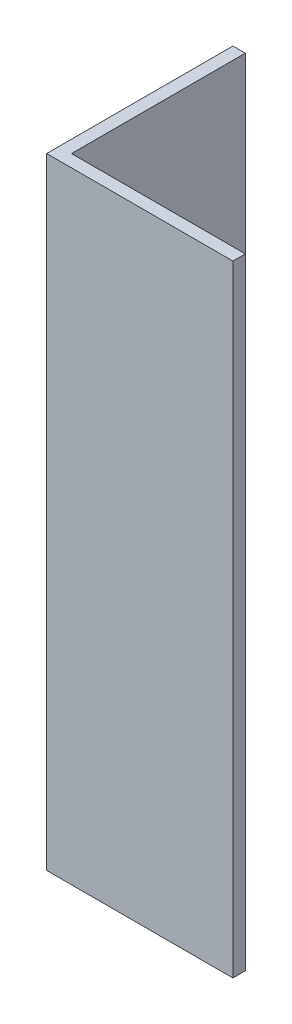
ISO-10303-21;
HEADER;
FILE_DESCRIPTION(('STEP AP214'),'2;1');
FILE_NAME('part.step','',(''),(''),'','','');
FILE_SCHEMA(('AUTOMOTIVE_DESIGN { 1 0 10303 214 1 1 1 1 }'));
ENDSEC;
DATA;
#1=APPLICATION_CONTEXT('core data for automotive mechanical design processes');
#2=APPLICATION_PROTOCOL_DEFINITION('international standard','automotive_design',2000,#1);
#3=PRODUCT_CONTEXT('',#1,'mechanical');
#4=PRODUCT('Part','Part','',(#3));
#5=PRODUCT_RELATED_PRODUCT_CATEGORY('part','',(#4));
#6=PRODUCT_DEFINITION_FORMATION('','',#4);
#7=PRODUCT_DEFINITION_CONTEXT('part definition',#1,'design');
#8=PRODUCT_DEFINITION('design','',#6,#7);
#9=PRODUCT_DEFINITION_SHAPE('','',#8);
#10=(LENGTH_UNIT() NAMED_UNIT(*) SI_UNIT(.MILLI.,.METRE.));
#11=(NAMED_UNIT(*) PLANE_ANGLE_UNIT() SI_UNIT($,.RADIAN.));
#12=(NAMED_UNIT(*) SI_UNIT($,.STERADIAN.) SOLID_ANGLE_UNIT());
#13=UNCERTAINTY_MEASURE_WITH_UNIT(LENGTH_MEASURE(1.E-05),#10,'distance_accuracy_value','');
#14=(GEOMETRIC_REPRESENTATION_CONTEXT(3) GLOBAL_UNCERTAINTY_ASSIGNED_CONTEXT((#13)) GLOBAL_UNIT_ASSIGNED_CONTEXT((#10,
#11,#12)) REPRESENTATION_CONTEXT('',''));
#15=CARTESIAN_POINT('',(0.,0.,0.));
#16=DIRECTION('',(0.,0.,1.));
#17=DIRECTION('',(1.,0.,0.));
#18=AXIS2_PLACEMENT_3D('',#15,#16,#17);
#19=CARTESIAN_POINT('',(15.,50.,0.));
#20=DIRECTION('',(0.,0.,-1.));
#21=DIRECTION('',(-1.,0.,0.));
#22=AXIS2_PLACEMENT_3D('',#19,#20,#21);
#23=PLANE('',#22);
#24=DIRECTION('',(1.,0.,0.));
#25=VECTOR('',#24,1.);
#26=CARTESIAN_POINT('',(15.,0.,0.));
#27=LINE('',#26,#25);
#28=CARTESIAN_POINT('',(0.,0.,0.));
#29=VERTEX_POINT('',#28);
#30=CARTESIAN_POINT('',(15.,0.,0.));
#31=VERTEX_POINT('',#30);
#32=EDGE_CURVE('E121',#29,#31,#27,.T.);
#33=ORIENTED_EDGE('',*,*,#32,.T.);
#34=DIRECTION('',(0.,-1.,0.));
#35=VECTOR('',#34,1.);
#36=CARTESIAN_POINT('',(15.,50.,0.));
#37=LINE('',#36,#35);
#38=CARTESIAN_POINT('',(15.,50.,0.));
#39=VERTEX_POINT('',#38);
#40=EDGE_CURVE('E11',#39,#31,#37,.T.);
#41=ORIENTED_EDGE('',*,*,#40,.F.);
#42=DIRECTION('',(1.,0.,0.));
#43=VECTOR('',#42,1.);
#44=CARTESIAN_POINT('',(15.,50.,0.));
#45=LINE('',#44,#43);
#46=CARTESIAN_POINT('',(0.,50.,0.));
#47=VERTEX_POINT('',#46);
#48=EDGE_CURVE('E131',#47,#39,#45,.T.);
#49=ORIENTED_EDGE('',*,*,#48,.F.);
#50=DIRECTION('',(0.,-1.,0.));
#51=VECTOR('',#50,1.);
#52=CARTESIAN_POINT('',(0.,50.,0.));
#53=LINE('',#52,#51);
#54=EDGE_CURVE('E117',#47,#29,#53,.T.);
#55=ORIENTED_EDGE('',*,*,#54,.T.);
#56=EDGE_LOOP('',(#33,#41,#49,#55));
#57=FACE_BOUND('',#56,.T.);
#58=ADVANCED_FACE('F37',(#57),#23,.F.);
#59=CARTESIAN_POINT('',(15.,50.,-0.999999999999998));
#60=DIRECTION('',(-1.,0.,0.));
#61=DIRECTION('',(0.,0.,1.));
#62=AXIS2_PLACEMENT_3D('',#59,#60,#61);
#63=PLANE('',#62);
#64=DIRECTION('',(0.,0.,-1.));
#65=VECTOR('',#64,1.);
#66=CARTESIAN_POINT('',(15.,0.,-0.999999999999998));
#67=LINE('',#66,#65);
#68=CARTESIAN_POINT('',(15.,0.,-0.999999999999998));
#69=VERTEX_POINT('',#68);
#70=EDGE_CURVE('E124',#31,#69,#67,.T.);
#71=ORIENTED_EDGE('',*,*,#70,.T.);
#72=DIRECTION('',(0.,-1.,0.));
#73=VECTOR('',#72,1.);
#74=CARTESIAN_POINT('',(15.,50.,-0.999999999999998));
#75=LINE('',#74,#73);
#76=CARTESIAN_POINT('',(15.,50.,-0.999999999999998));
#77=VERTEX_POINT('',#76);
#78=EDGE_CURVE('E45',#77,#69,#75,.T.);
#79=ORIENTED_EDGE('',*,*,#78,.F.);
#80=DIRECTION('',(0.,0.,-1.));
#81=VECTOR('',#80,1.);
#82=CARTESIAN_POINT('',(15.,50.,-0.999999999999998));
#83=LINE('',#82,#81);
#84=EDGE_CURVE('E90',#39,#77,#83,.T.);
#85=ORIENTED_EDGE('',*,*,#84,.F.);
#86=ORIENTED_EDGE('',*,*,#40,.T.);
#87=EDGE_LOOP('',(#71,#79,#85,#86));
#88=FACE_BOUND('',#87,.T.);
#89=ADVANCED_FACE('F155',(#88),#63,.F.);
#90=CARTESIAN_POINT('',(1.,50.,-0.999999999999997));
#91=DIRECTION('',(0.,0.,1.));
#92=DIRECTION('',(1.,0.,0.));
#93=AXIS2_PLACEMENT_3D('',#90,#91,#92);
#94=PLANE('',#93);
#95=DIRECTION('',(-1.,0.,0.));
#96=VECTOR('',#95,1.);
#97=CARTESIAN_POINT('',(1.,0.,-0.999999999999997));
#98=LINE('',#97,#96);
#99=CARTESIAN_POINT('',(1.,0.,-0.999999999999997));
#100=VERTEX_POINT('',#99);
#101=EDGE_CURVE('E126',#69,#100,#98,.T.);
#102=ORIENTED_EDGE('',*,*,#101,.T.);
#103=DIRECTION('',(0.,-1.,0.));
#104=VECTOR('',#103,1.);
#105=CARTESIAN_POINT('',(1.,50.,-0.999999999999997));
#106=LINE('',#105,#104);
#107=CARTESIAN_POINT('',(1.,50.,-0.999999999999997));
#108=VERTEX_POINT('',#107);
#109=EDGE_CURVE('E112',#108,#100,#106,.T.);
#110=ORIENTED_EDGE('',*,*,#109,.F.);
#111=DIRECTION('',(-1.,0.,0.));
#112=VECTOR('',#111,1.);
#113=CARTESIAN_POINT('',(1.,50.,-0.999999999999997));
#114=LINE('',#113,#112);
#115=EDGE_CURVE('E103',#77,#108,#114,.T.);
#116=ORIENTED_EDGE('',*,*,#115,.F.);
#117=ORIENTED_EDGE('',*,*,#78,.T.);
#118=EDGE_LOOP('',(#102,#110,#116,#117));
#119=FACE_BOUND('',#118,.T.);
#120=ADVANCED_FACE('F137',(#119),#94,.F.);
#121=CARTESIAN_POINT('',(0.999999999999998,50.,-15.));
#122=DIRECTION('',(-1.,0.,0.));
#123=DIRECTION('',(0.,0.,1.));
#124=AXIS2_PLACEMENT_3D('',#121,#122,#123);
#125=PLANE('',#124);
#126=DIRECTION('',(0.,0.,-1.));
#127=VECTOR('',#126,1.);
#128=CARTESIAN_POINT('',(0.999999999999998,0.,-15.));
#129=LINE('',#128,#127);
#130=CARTESIAN_POINT('',(0.999999999999998,0.,-15.));
#131=VERTEX_POINT('',#130);
#132=EDGE_CURVE('E111',#100,#131,#129,.T.);
#133=ORIENTED_EDGE('',*,*,#132,.T.);
#134=DIRECTION('',(0.,-1.,0.));
#135=VECTOR('',#134,1.);
#136=CARTESIAN_POINT('',(0.999999999999998,50.,-15.));
#137=LINE('',#136,#135);
#138=CARTESIAN_POINT('',(0.999999999999998,50.,-15.));
#139=VERTEX_POINT('',#138);
#140=EDGE_CURVE('E108',#139,#131,#137,.T.);
#141=ORIENTED_EDGE('',*,*,#140,.F.);
#142=DIRECTION('',(0.,0.,-1.));
#143=VECTOR('',#142,1.);
#144=CARTESIAN_POINT('',(0.999999999999998,50.,-15.));
#145=LINE('',#144,#143);
#146=EDGE_CURVE('E97',#108,#139,#145,.T.);
#147=ORIENTED_EDGE('',*,*,#146,.F.);
#148=ORIENTED_EDGE('',*,*,#109,.T.);
#149=EDGE_LOOP('',(#133,#141,#147,#148));
#150=FACE_BOUND('',#149,.T.);
#151=ADVANCED_FACE('F109',(#150),#125,.F.);
#152=CARTESIAN_POINT('',(0.,50.,-15.));
#153=DIRECTION('',(0.,0.,1.));
#154=DIRECTION('',(1.,0.,0.));
#155=AXIS2_PLACEMENT_3D('',#152,#153,#154);
#156=PLANE('',#155);
#157=DIRECTION('',(-1.,0.,0.));
#158=VECTOR('',#157,1.);
#159=CARTESIAN_POINT('',(0.,0.,-15.));
#160=LINE('',#159,#158);
#161=CARTESIAN_POINT('',(0.,0.,-15.));
#162=VERTEX_POINT('',#161);
#163=EDGE_CURVE('E76',#131,#162,#160,.T.);
#164=ORIENTED_EDGE('',*,*,#163,.T.);
#165=DIRECTION('',(0.,-1.,0.));
#166=VECTOR('',#165,1.);
#167=CARTESIAN_POINT('',(0.,50.,-15.));
#168=LINE('',#167,#166);
#169=CARTESIAN_POINT('',(0.,50.,-15.));
#170=VERTEX_POINT('',#169);
#171=EDGE_CURVE('E113',#170,#162,#168,.T.);
#172=ORIENTED_EDGE('',*,*,#171,.F.);
#173=DIRECTION('',(-1.,0.,0.));
#174=VECTOR('',#173,1.);
#175=CARTESIAN_POINT('',(0.,50.,-15.));
#176=LINE('',#175,#174);
#177=EDGE_CURVE('E101',#139,#170,#176,.T.);
#178=ORIENTED_EDGE('',*,*,#177,.F.);
#179=ORIENTED_EDGE('',*,*,#140,.T.);
#180=EDGE_LOOP('',(#164,#172,#178,#179));
#181=FACE_BOUND('',#180,.T.);
#182=ADVANCED_FACE('F115',(#181),#156,.F.);
#183=CARTESIAN_POINT('',(0.,50.,0.));
#184=DIRECTION('',(1.,0.,0.));
#185=DIRECTION('',(0.,0.,-1.));
#186=AXIS2_PLACEMENT_3D('',#183,#184,#185);
#187=PLANE('',#186);
#188=DIRECTION('',(0.,0.,1.));
#189=VECTOR('',#188,1.);
#190=CARTESIAN_POINT('',(0.,0.,0.));
#191=LINE('',#190,#189);
#192=EDGE_CURVE('E82',#162,#29,#191,.T.);
#193=ORIENTED_EDGE('',*,*,#192,.T.);
#194=ORIENTED_EDGE('',*,*,#54,.F.);
#195=DIRECTION('',(0.,0.,1.));
#196=VECTOR('',#195,1.);
#197=CARTESIAN_POINT('',(0.,50.,0.));
#198=LINE('',#197,#196);
#199=EDGE_CURVE('E53',#170,#47,#198,.T.);
#200=ORIENTED_EDGE('',*,*,#199,.F.);
#201=ORIENTED_EDGE('',*,*,#171,.T.);
#202=EDGE_LOOP('',(#193,#194,#200,#201));
#203=FACE_BOUND('',#202,.T.);
#204=ADVANCED_FACE('F144',(#203),#187,.F.);
#205=CARTESIAN_POINT('',(0.,50.,0.));
#206=DIRECTION('',(0.,-1.,0.));
#207=DIRECTION('',(0.,0.,-1.));
#208=AXIS2_PLACEMENT_3D('',#205,#206,#207);
#209=PLANE('',#208);
#210=ORIENTED_EDGE('',*,*,#48,.T.);
#211=ORIENTED_EDGE('',*,*,#84,.T.);
#212=ORIENTED_EDGE('',*,*,#115,.T.);
#213=ORIENTED_EDGE('',*,*,#146,.T.);
#214=ORIENTED_EDGE('',*,*,#177,.T.);
#215=ORIENTED_EDGE('',*,*,#199,.T.);
#216=EDGE_LOOP('',(#210,#211,#212,#213,#214,#215));
#217=FACE_BOUND('',#216,.T.);
#218=ADVANCED_FACE('F99',(#217),#209,.F.);
#219=CARTESIAN_POINT('',(0.,0.,0.));
#220=DIRECTION('',(0.,-1.,0.));
#221=DIRECTION('',(0.,0.,-1.));
#222=AXIS2_PLACEMENT_3D('',#219,#220,#221);
#223=PLANE('',#222);
#224=ORIENTED_EDGE('',*,*,#32,.F.);
#225=ORIENTED_EDGE('',*,*,#192,.F.);
#226=ORIENTED_EDGE('',*,*,#163,.F.);
#227=ORIENTED_EDGE('',*,*,#132,.F.);
#228=ORIENTED_EDGE('',*,*,#101,.F.);
#229=ORIENTED_EDGE('',*,*,#70,.F.);
#230=EDGE_LOOP('',(#224,#225,#226,#227,#228,#229));
#231=FACE_BOUND('',#230,.T.);
#232=ADVANCED_FACE('F140',(#231),#223,.T.);
#233=CLOSED_SHELL('',(#58,#89,#120,#151,#182,#204,#218,#232));
#234=MANIFOLD_SOLID_BREP('B2',#233);
#235=ADVANCED_BREP_SHAPE_REPRESENTATION('',(#18,#234),#14);
#236=SHAPE_DEFINITION_REPRESENTATION(#9,#235);
ENDSEC;
END-ISO-10303-21;
